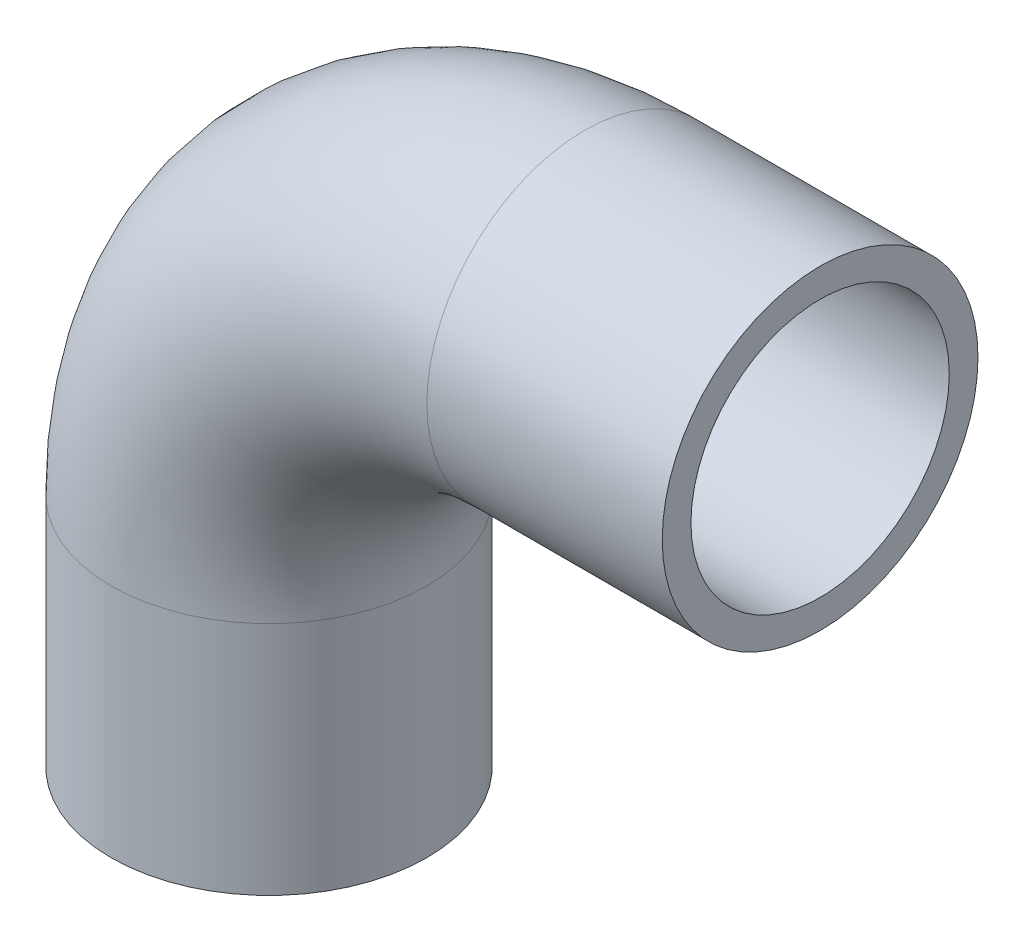
ISO-10303-21;
HEADER;
FILE_DESCRIPTION(('STEP AP214'),'2;1');
FILE_NAME('part.step','',(''),(''),'','','');
FILE_SCHEMA(('AUTOMOTIVE_DESIGN { 1 0 10303 214 1 1 1 1 }'));
ENDSEC;
DATA;
#1=APPLICATION_CONTEXT('core data for automotive mechanical design processes');
#2=APPLICATION_PROTOCOL_DEFINITION('international standard','automotive_design',2000,#1);
#3=PRODUCT_CONTEXT('',#1,'mechanical');
#4=PRODUCT('Part','Part','',(#3));
#5=PRODUCT_RELATED_PRODUCT_CATEGORY('part','',(#4));
#6=PRODUCT_DEFINITION_FORMATION('','',#4);
#7=PRODUCT_DEFINITION_CONTEXT('part definition',#1,'design');
#8=PRODUCT_DEFINITION('design','',#6,#7);
#9=PRODUCT_DEFINITION_SHAPE('','',#8);
#10=(LENGTH_UNIT() NAMED_UNIT(*) SI_UNIT(.MILLI.,.METRE.));
#11=(NAMED_UNIT(*) PLANE_ANGLE_UNIT() SI_UNIT($,.RADIAN.));
#12=(NAMED_UNIT(*) SI_UNIT($,.STERADIAN.) SOLID_ANGLE_UNIT());
#13=UNCERTAINTY_MEASURE_WITH_UNIT(LENGTH_MEASURE(1.E-05),#10,'distance_accuracy_value','');
#14=(GEOMETRIC_REPRESENTATION_CONTEXT(3) GLOBAL_UNCERTAINTY_ASSIGNED_CONTEXT((#13)) GLOBAL_UNIT_ASSIGNED_CONTEXT((#10,
#11,#12)) REPRESENTATION_CONTEXT('',''));
#15=CARTESIAN_POINT('',(0.,0.,0.));
#16=DIRECTION('',(0.,0.,1.));
#17=DIRECTION('',(1.,0.,0.));
#18=AXIS2_PLACEMENT_3D('',#15,#16,#17);
#19=CARTESIAN_POINT('',(110.,82.,0.));
#20=DIRECTION('',(0.,0.,1.));
#21=DIRECTION('',(1.,0.,0.));
#22=AXIS2_PLACEMENT_3D('',#19,#20,#21);
#23=TOROIDAL_SURFACE('',#22,110.,45.);
#24=CARTESIAN_POINT('',(110.,192.,0.));
#25=DIRECTION('',(-1.,0.,0.));
#26=DIRECTION('',(0.,1.,0.));
#27=AXIS2_PLACEMENT_3D('',#24,#25,#26);
#28=CIRCLE('',#27,45.);
#29=CARTESIAN_POINT('',(110.,237.,0.));
#30=VERTEX_POINT('',#29);
#31=EDGE_CURVE('E33',#30,#30,#28,.T.);
#32=ORIENTED_EDGE('',*,*,#31,.F.);
#33=EDGE_LOOP('',(#32));
#34=FACE_BOUND('',#33,.T.);
#35=CARTESIAN_POINT('',(0.,82.,0.));
#36=DIRECTION('',(0.,-1.,0.));
#37=DIRECTION('',(-1.,0.,0.));
#38=AXIS2_PLACEMENT_3D('',#35,#36,#37);
#39=CIRCLE('',#38,45.);
#40=CARTESIAN_POINT('',(-45.,82.,0.));
#41=VERTEX_POINT('',#40);
#42=EDGE_CURVE('E31',#41,#41,#39,.F.);
#43=ORIENTED_EDGE('',*,*,#42,.F.);
#44=EDGE_LOOP('',(#43));
#45=FACE_BOUND('',#44,.T.);
#46=ADVANCED_FACE('F13',(#34,#45),#23,.F.);
#47=CARTESIAN_POINT('',(192.,192.,0.));
#48=DIRECTION('',(-1.,0.,0.));
#49=DIRECTION('',(0.,0.,1.));
#50=AXIS2_PLACEMENT_3D('',#47,#48,#49);
#51=CYLINDRICAL_SURFACE('',#50,45.);
#52=CARTESIAN_POINT('',(192.,192.,0.));
#53=DIRECTION('',(-1.,0.,0.));
#54=DIRECTION('',(0.,0.,1.));
#55=AXIS2_PLACEMENT_3D('',#52,#53,#54);
#56=CIRCLE('',#55,45.);
#57=CARTESIAN_POINT('',(192.,192.,45.));
#58=VERTEX_POINT('',#57);
#59=EDGE_CURVE('E17',#58,#58,#56,.T.);
#60=ORIENTED_EDGE('',*,*,#59,.F.);
#61=EDGE_LOOP('',(#60));
#62=FACE_BOUND('',#61,.T.);
#63=ORIENTED_EDGE('',*,*,#31,.T.);
#64=EDGE_LOOP('',(#63));
#65=FACE_BOUND('',#64,.T.);
#66=ADVANCED_FACE('F52',(#62,#65),#51,.F.);
#67=CARTESIAN_POINT('',(0.,82.,0.));
#68=DIRECTION('',(0.,-1.,0.));
#69=DIRECTION('',(0.,0.,-1.));
#70=AXIS2_PLACEMENT_3D('',#67,#68,#69);
#71=CYLINDRICAL_SURFACE('',#70,45.);
#72=ORIENTED_EDGE('',*,*,#42,.T.);
#73=EDGE_LOOP('',(#72));
#74=FACE_BOUND('',#73,.T.);
#75=CARTESIAN_POINT('',(0.,0.,0.));
#76=DIRECTION('',(0.,-1.,0.));
#77=DIRECTION('',(0.,0.,-1.));
#78=AXIS2_PLACEMENT_3D('',#75,#76,#77);
#79=CIRCLE('',#78,45.);
#80=CARTESIAN_POINT('',(0.,0.,-45.));
#81=VERTEX_POINT('',#80);
#82=EDGE_CURVE('E42',#81,#81,#79,.F.);
#83=ORIENTED_EDGE('',*,*,#82,.F.);
#84=EDGE_LOOP('',(#83));
#85=FACE_BOUND('',#84,.T.);
#86=ADVANCED_FACE('F55',(#74,#85),#71,.F.);
#87=CARTESIAN_POINT('',(192.,247.,55.6600021083519));
#88=DIRECTION('',(1.,0.,0.));
#89=DIRECTION('',(0.,-1.,0.));
#90=AXIS2_PLACEMENT_3D('',#87,#88,#89);
#91=PLANE('',#90);
#92=ORIENTED_EDGE('',*,*,#59,.T.);
#93=EDGE_LOOP('',(#92));
#94=FACE_BOUND('',#93,.T.);
#95=CARTESIAN_POINT('',(192.,192.,0.));
#96=DIRECTION('',(-1.,0.,0.));
#97=DIRECTION('',(0.,0.,1.));
#98=AXIS2_PLACEMENT_3D('',#95,#96,#97);
#99=CIRCLE('',#98,55.);
#100=CARTESIAN_POINT('',(192.,192.,55.));
#101=VERTEX_POINT('',#100);
#102=EDGE_CURVE('E40',#101,#101,#99,.T.);
#103=ORIENTED_EDGE('',*,*,#102,.F.);
#104=EDGE_LOOP('',(#103));
#105=FACE_BOUND('',#104,.T.);
#106=ADVANCED_FACE('F49',(#94,#105),#91,.T.);
#107=CARTESIAN_POINT('',(55.,0.,55.660002108172));
#108=DIRECTION('',(0.,-1.,0.));
#109=DIRECTION('',(-1.,0.,0.));
#110=AXIS2_PLACEMENT_3D('',#107,#108,#109);
#111=PLANE('',#110);
#112=ORIENTED_EDGE('',*,*,#82,.T.);
#113=EDGE_LOOP('',(#112));
#114=FACE_BOUND('',#113,.T.);
#115=CARTESIAN_POINT('',(0.,0.,0.));
#116=DIRECTION('',(0.,-1.,0.));
#117=DIRECTION('',(0.,0.,-1.));
#118=AXIS2_PLACEMENT_3D('',#115,#116,#117);
#119=CIRCLE('',#118,55.);
#120=CARTESIAN_POINT('',(0.,0.,-55.));
#121=VERTEX_POINT('',#120);
#122=EDGE_CURVE('E26',#121,#121,#119,.F.);
#123=ORIENTED_EDGE('',*,*,#122,.F.);
#124=EDGE_LOOP('',(#123));
#125=FACE_BOUND('',#124,.T.);
#126=ADVANCED_FACE('F69',(#114,#125),#111,.T.);
#127=CARTESIAN_POINT('',(110.,192.,0.));
#128=DIRECTION('',(-1.,0.,0.));
#129=DIRECTION('',(0.,0.,1.));
#130=AXIS2_PLACEMENT_3D('',#127,#128,#129);
#131=CYLINDRICAL_SURFACE('',#130,55.);
#132=ORIENTED_EDGE('',*,*,#102,.T.);
#133=EDGE_LOOP('',(#132));
#134=FACE_BOUND('',#133,.T.);
#135=CARTESIAN_POINT('',(110.,192.,0.));
#136=DIRECTION('',(-1.,0.,0.));
#137=DIRECTION('',(0.,-1.,0.));
#138=AXIS2_PLACEMENT_3D('',#135,#136,#137);
#139=CIRCLE('',#138,55.);
#140=CARTESIAN_POINT('',(110.,137.,0.));
#141=VERTEX_POINT('',#140);
#142=EDGE_CURVE('E21',#141,#141,#139,.T.);
#143=ORIENTED_EDGE('',*,*,#142,.F.);
#144=EDGE_LOOP('',(#143));
#145=FACE_BOUND('',#144,.T.);
#146=ADVANCED_FACE('F79',(#134,#145),#131,.T.);
#147=CARTESIAN_POINT('',(0.,0.,0.));
#148=DIRECTION('',(0.,-1.,0.));
#149=DIRECTION('',(0.,0.,-1.));
#150=AXIS2_PLACEMENT_3D('',#147,#148,#149);
#151=CYLINDRICAL_SURFACE('',#150,55.);
#152=CARTESIAN_POINT('',(0.,82.,0.));
#153=DIRECTION('',(0.,-1.,0.));
#154=DIRECTION('',(1.,0.,0.));
#155=AXIS2_PLACEMENT_3D('',#152,#153,#154);
#156=CIRCLE('',#155,55.);
#157=CARTESIAN_POINT('',(55.,82.,0.));
#158=VERTEX_POINT('',#157);
#159=EDGE_CURVE('E8',#158,#158,#156,.F.);
#160=ORIENTED_EDGE('',*,*,#159,.F.);
#161=EDGE_LOOP('',(#160));
#162=FACE_BOUND('',#161,.T.);
#163=ORIENTED_EDGE('',*,*,#122,.T.);
#164=EDGE_LOOP('',(#163));
#165=FACE_BOUND('',#164,.T.);
#166=ADVANCED_FACE('F73',(#162,#165),#151,.T.);
#167=CARTESIAN_POINT('',(110.,82.,0.));
#168=DIRECTION('',(0.,0.,1.));
#169=DIRECTION('',(1.,0.,0.));
#170=AXIS2_PLACEMENT_3D('',#167,#168,#169);
#171=TOROIDAL_SURFACE('',#170,110.,55.);
#172=ORIENTED_EDGE('',*,*,#142,.T.);
#173=EDGE_LOOP('',(#172));
#174=FACE_BOUND('',#173,.T.);
#175=ORIENTED_EDGE('',*,*,#159,.T.);
#176=EDGE_LOOP('',(#175));
#177=FACE_BOUND('',#176,.T.);
#178=ADVANCED_FACE('F71',(#174,#177),#171,.T.);
#179=CLOSED_SHELL('',(#46,#66,#86,#106,#126,#146,#166,#178));
#180=MANIFOLD_SOLID_BREP('B1',#179);
#181=ADVANCED_BREP_SHAPE_REPRESENTATION('',(#18,#180),#14);
#182=SHAPE_DEFINITION_REPRESENTATION(#9,#181);
ENDSEC;
END-ISO-10303-21;
